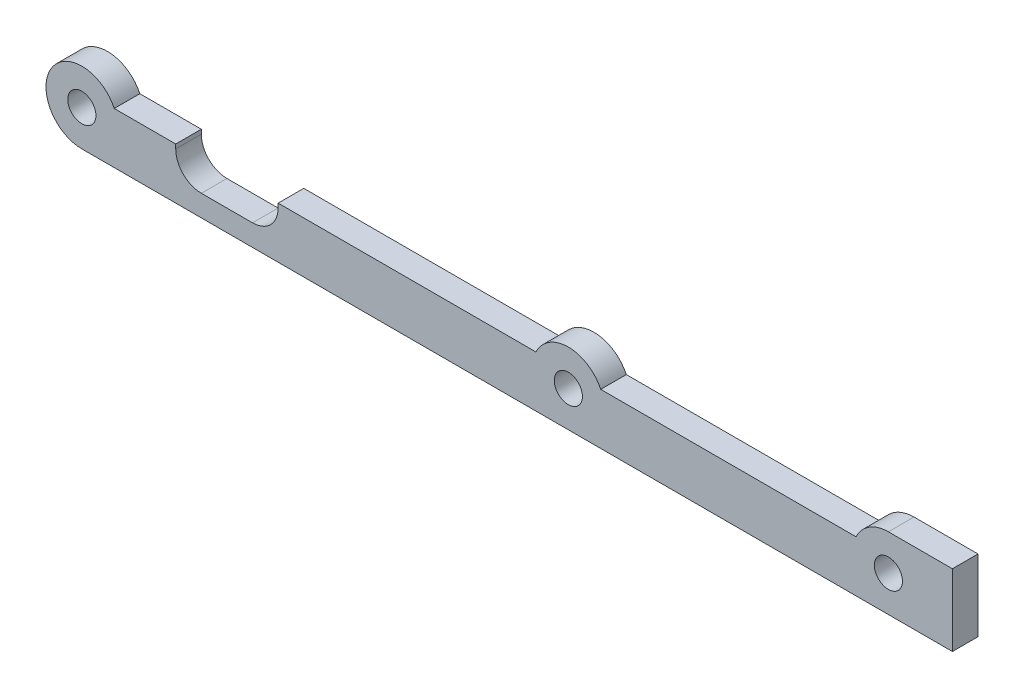
ISO-10303-21;
HEADER;
FILE_DESCRIPTION(('STEP AP214'),'2;1');
FILE_NAME('part.step','',(''),(''),'','','');
FILE_SCHEMA(('AUTOMOTIVE_DESIGN { 1 0 10303 214 1 1 1 1 }'));
ENDSEC;
DATA;
#1=APPLICATION_CONTEXT('core data for automotive mechanical design processes');
#2=APPLICATION_PROTOCOL_DEFINITION('international standard','automotive_design',2000,#1);
#3=PRODUCT_CONTEXT('',#1,'mechanical');
#4=PRODUCT('Part','Part','',(#3));
#5=PRODUCT_RELATED_PRODUCT_CATEGORY('part','',(#4));
#6=PRODUCT_DEFINITION_FORMATION('','',#4);
#7=PRODUCT_DEFINITION_CONTEXT('part definition',#1,'design');
#8=PRODUCT_DEFINITION('design','',#6,#7);
#9=PRODUCT_DEFINITION_SHAPE('','',#8);
#10=(LENGTH_UNIT() NAMED_UNIT(*) SI_UNIT(.MILLI.,.METRE.));
#11=(NAMED_UNIT(*) PLANE_ANGLE_UNIT() SI_UNIT($,.RADIAN.));
#12=(NAMED_UNIT(*) SI_UNIT($,.STERADIAN.) SOLID_ANGLE_UNIT());
#13=UNCERTAINTY_MEASURE_WITH_UNIT(LENGTH_MEASURE(1.E-05),#10,'distance_accuracy_value','');
#14=(GEOMETRIC_REPRESENTATION_CONTEXT(3) GLOBAL_UNCERTAINTY_ASSIGNED_CONTEXT((#13)) GLOBAL_UNIT_ASSIGNED_CONTEXT((#10,
#11,#12)) REPRESENTATION_CONTEXT('',''));
#15=CARTESIAN_POINT('',(0.,0.,0.));
#16=DIRECTION('',(0.,0.,1.));
#17=DIRECTION('',(1.,0.,0.));
#18=AXIS2_PLACEMENT_3D('',#15,#16,#17);
#19=CARTESIAN_POINT('',(-57.,0.,3.));
#20=DIRECTION('',(0.,0.,-1.));
#21=DIRECTION('',(-1.,0.,0.));
#22=AXIS2_PLACEMENT_3D('',#19,#20,#21);
#23=PLANE('',#22);
#24=CARTESIAN_POINT('',(-57.,0.,3.));
#25=DIRECTION('',(0.,0.,1.));
#26=DIRECTION('',(1.,0.,0.));
#27=AXIS2_PLACEMENT_3D('',#24,#25,#26);
#28=CIRCLE('',#27,1.65);
#29=CARTESIAN_POINT('',(-55.35,0.,3.));
#30=VERTEX_POINT('',#29);
#31=EDGE_CURVE('E500',#30,#30,#28,.T.);
#32=ORIENTED_EDGE('',*,*,#31,.F.);
#33=EDGE_LOOP('',(#32));
#34=FACE_BOUND('',#33,.T.);
#35=CARTESIAN_POINT('',(-57.,0.,3.));
#36=DIRECTION('',(0.,0.,1.));
#37=DIRECTION('',(-1.,0.,0.));
#38=AXIS2_PLACEMENT_3D('',#35,#36,#37);
#39=CIRCLE('',#38,4.2);
#40=CARTESIAN_POINT('',(-53.205266807798,1.8,3.));
#41=VERTEX_POINT('',#40);
#42=CARTESIAN_POINT('',(-57.,-4.2,3.));
#43=VERTEX_POINT('',#42);
#44=EDGE_CURVE('E165',#41,#43,#39,.T.);
#45=ORIENTED_EDGE('',*,*,#44,.T.);
#46=DIRECTION('',(1.,0.,0.));
#47=VECTOR('',#46,1.);
#48=CARTESIAN_POINT('',(-57.,-4.2,3.));
#49=LINE('',#48,#47);
#50=CARTESIAN_POINT('',(45.,-4.2,3.));
#51=VERTEX_POINT('',#50);
#52=EDGE_CURVE('E154',#43,#51,#49,.T.);
#53=ORIENTED_EDGE('',*,*,#52,.T.);
#54=DIRECTION('',(0.,1.,0.));
#55=VECTOR('',#54,1.);
#56=CARTESIAN_POINT('',(45.,-4.2,3.));
#57=LINE('',#56,#55);
#58=CARTESIAN_POINT('',(45.,4.2,3.));
#59=VERTEX_POINT('',#58);
#60=EDGE_CURVE('E164',#51,#59,#57,.T.);
#61=ORIENTED_EDGE('',*,*,#60,.T.);
#62=DIRECTION('',(-1.,0.,0.));
#63=VECTOR('',#62,1.);
#64=CARTESIAN_POINT('',(37.5,4.2,3.));
#65=LINE('',#64,#63);
#66=CARTESIAN_POINT('',(37.5,4.2,3.));
#67=VERTEX_POINT('',#66);
#68=EDGE_CURVE('E286',#59,#67,#65,.T.);
#69=ORIENTED_EDGE('',*,*,#68,.T.);
#70=CARTESIAN_POINT('',(37.5,0.,3.));
#71=DIRECTION('',(0.,0.,1.));
#72=DIRECTION('',(1.,0.,0.));
#73=AXIS2_PLACEMENT_3D('',#70,#71,#72);
#74=CIRCLE('',#73,4.2);
#75=CARTESIAN_POINT('',(33.7052668077979,1.8,3.));
#76=VERTEX_POINT('',#75);
#77=EDGE_CURVE('E303',#67,#76,#74,.T.);
#78=ORIENTED_EDGE('',*,*,#77,.T.);
#79=DIRECTION('',(-1.,0.,0.));
#80=VECTOR('',#79,1.);
#81=CARTESIAN_POINT('',(3.79473319220206,1.8,3.));
#82=LINE('',#81,#80);
#83=CARTESIAN_POINT('',(3.79473319220206,1.8,3.));
#84=VERTEX_POINT('',#83);
#85=EDGE_CURVE('E300',#76,#84,#82,.T.);
#86=ORIENTED_EDGE('',*,*,#85,.T.);
#87=CARTESIAN_POINT('',(0.,0.,3.));
#88=DIRECTION('',(0.,0.,1.));
#89=DIRECTION('',(1.,0.,0.));
#90=AXIS2_PLACEMENT_3D('',#87,#88,#89);
#91=CIRCLE('',#90,4.2);
#92=CARTESIAN_POINT('',(-3.79473319220206,1.8,3.));
#93=VERTEX_POINT('',#92);
#94=EDGE_CURVE('E302',#84,#93,#91,.T.);
#95=ORIENTED_EDGE('',*,*,#94,.T.);
#96=DIRECTION('',(-1.,0.,0.));
#97=VECTOR('',#96,1.);
#98=CARTESIAN_POINT('',(-34.,1.8,3.));
#99=LINE('',#98,#97);
#100=CARTESIAN_POINT('',(-34.,1.8,3.));
#101=VERTEX_POINT('',#100);
#102=EDGE_CURVE('E305',#93,#101,#99,.T.);
#103=ORIENTED_EDGE('',*,*,#102,.T.);
#104=DIRECTION('',(0.,-1.,0.));
#105=VECTOR('',#104,1.);
#106=CARTESIAN_POINT('',(-34.,-1.7,3.));
#107=LINE('',#106,#105);
#108=CARTESIAN_POINT('',(-34.,1.3,3.));
#109=VERTEX_POINT('',#108);
#110=EDGE_CURVE('E233',#101,#109,#107,.T.);
#111=ORIENTED_EDGE('',*,*,#110,.T.);
#112=CARTESIAN_POINT('',(-37.,1.3,3.));
#113=DIRECTION('',(0.,0.,-1.));
#114=DIRECTION('',(-1.,0.,0.));
#115=AXIS2_PLACEMENT_3D('',#112,#113,#114);
#116=CIRCLE('',#115,3.);
#117=CARTESIAN_POINT('',(-37.,-1.7,3.));
#118=VERTEX_POINT('',#117);
#119=EDGE_CURVE('E200',#109,#118,#116,.T.);
#120=ORIENTED_EDGE('',*,*,#119,.T.);
#121=DIRECTION('',(-1.,0.,0.));
#122=VECTOR('',#121,1.);
#123=CARTESIAN_POINT('',(-46.,-1.7,3.));
#124=LINE('',#123,#122);
#125=CARTESIAN_POINT('',(-43.,-1.7,3.));
#126=VERTEX_POINT('',#125);
#127=EDGE_CURVE('E227',#118,#126,#124,.T.);
#128=ORIENTED_EDGE('',*,*,#127,.T.);
#129=CARTESIAN_POINT('',(-43.,1.3,3.));
#130=DIRECTION('',(0.,0.,-1.));
#131=DIRECTION('',(-1.,0.,0.));
#132=AXIS2_PLACEMENT_3D('',#129,#130,#131);
#133=CIRCLE('',#132,3.);
#134=CARTESIAN_POINT('',(-46.,1.3,3.));
#135=VERTEX_POINT('',#134);
#136=EDGE_CURVE('E11',#126,#135,#133,.T.);
#137=ORIENTED_EDGE('',*,*,#136,.T.);
#138=DIRECTION('',(0.,1.,0.));
#139=VECTOR('',#138,1.);
#140=CARTESIAN_POINT('',(-46.,1.8,3.));
#141=LINE('',#140,#139);
#142=CARTESIAN_POINT('',(-46.,1.8,3.));
#143=VERTEX_POINT('',#142);
#144=EDGE_CURVE('E224',#135,#143,#141,.T.);
#145=ORIENTED_EDGE('',*,*,#144,.T.);
#146=DIRECTION('',(-1.,0.,0.));
#147=VECTOR('',#146,1.);
#148=CARTESIAN_POINT('',(-53.205266807798,1.8,3.));
#149=LINE('',#148,#147);
#150=EDGE_CURVE('E170',#143,#41,#149,.T.);
#151=ORIENTED_EDGE('',*,*,#150,.T.);
#152=EDGE_LOOP('',(#45,#53,#61,#69,#78,#86,#95,#103,#111,#120,#128,#137,#145,#151));
#153=FACE_BOUND('',#152,.T.);
#154=CARTESIAN_POINT('',(0.,0.,3.));
#155=DIRECTION('',(0.,0.,1.));
#156=DIRECTION('',(1.,0.,0.));
#157=AXIS2_PLACEMENT_3D('',#154,#155,#156);
#158=CIRCLE('',#157,1.65);
#159=CARTESIAN_POINT('',(1.65,0.,3.));
#160=VERTEX_POINT('',#159);
#161=EDGE_CURVE('E239',#160,#160,#158,.T.);
#162=ORIENTED_EDGE('',*,*,#161,.F.);
#163=EDGE_LOOP('',(#162));
#164=FACE_BOUND('',#163,.T.);
#165=CARTESIAN_POINT('',(37.5,0.,3.));
#166=DIRECTION('',(0.,0.,1.));
#167=DIRECTION('',(1.,0.,0.));
#168=AXIS2_PLACEMENT_3D('',#165,#166,#167);
#169=CIRCLE('',#168,1.65);
#170=CARTESIAN_POINT('',(39.15,0.,3.));
#171=VERTEX_POINT('',#170);
#172=EDGE_CURVE('E507',#171,#171,#169,.T.);
#173=ORIENTED_EDGE('',*,*,#172,.F.);
#174=EDGE_LOOP('',(#173));
#175=FACE_BOUND('',#174,.T.);
#176=ADVANCED_FACE('F41',(#34,#153,#164,#175),#23,.F.);
#177=CARTESIAN_POINT('',(-57.,0.,0.));
#178=DIRECTION('',(0.,0.,-1.));
#179=DIRECTION('',(-1.,0.,0.));
#180=AXIS2_PLACEMENT_3D('',#177,#178,#179);
#181=PLANE('',#180);
#182=CARTESIAN_POINT('',(-57.,0.,0.));
#183=DIRECTION('',(0.,0.,1.));
#184=DIRECTION('',(1.,0.,0.));
#185=AXIS2_PLACEMENT_3D('',#182,#183,#184);
#186=CIRCLE('',#185,1.65);
#187=CARTESIAN_POINT('',(-55.35,0.,0.));
#188=VERTEX_POINT('',#187);
#189=EDGE_CURVE('E504',#188,#188,#186,.T.);
#190=ORIENTED_EDGE('',*,*,#189,.T.);
#191=EDGE_LOOP('',(#190));
#192=FACE_BOUND('',#191,.T.);
#193=CARTESIAN_POINT('',(-57.,0.,0.));
#194=DIRECTION('',(0.,0.,1.));
#195=DIRECTION('',(-1.,0.,0.));
#196=AXIS2_PLACEMENT_3D('',#193,#194,#195);
#197=CIRCLE('',#196,4.2);
#198=CARTESIAN_POINT('',(-53.205266807798,1.8,0.));
#199=VERTEX_POINT('',#198);
#200=CARTESIAN_POINT('',(-57.,-4.2,0.));
#201=VERTEX_POINT('',#200);
#202=EDGE_CURVE('E178',#199,#201,#197,.T.);
#203=ORIENTED_EDGE('',*,*,#202,.F.);
#204=DIRECTION('',(-1.,0.,0.));
#205=VECTOR('',#204,1.);
#206=CARTESIAN_POINT('',(-53.205266807798,1.8,0.));
#207=LINE('',#206,#205);
#208=CARTESIAN_POINT('',(-46.,1.8,0.));
#209=VERTEX_POINT('',#208);
#210=EDGE_CURVE('E174',#209,#199,#207,.T.);
#211=ORIENTED_EDGE('',*,*,#210,.F.);
#212=DIRECTION('',(0.,1.,0.));
#213=VECTOR('',#212,1.);
#214=CARTESIAN_POINT('',(-46.,1.8,0.));
#215=LINE('',#214,#213);
#216=CARTESIAN_POINT('',(-46.,1.3,0.));
#217=VERTEX_POINT('',#216);
#218=EDGE_CURVE('E213',#217,#209,#215,.T.);
#219=ORIENTED_EDGE('',*,*,#218,.F.);
#220=CARTESIAN_POINT('',(-43.,1.3,0.));
#221=DIRECTION('',(0.,0.,-1.));
#222=DIRECTION('',(-1.,0.,0.));
#223=AXIS2_PLACEMENT_3D('',#220,#221,#222);
#224=CIRCLE('',#223,3.);
#225=CARTESIAN_POINT('',(-43.,-1.7,0.));
#226=VERTEX_POINT('',#225);
#227=EDGE_CURVE('E50',#217,#226,#224,.F.);
#228=ORIENTED_EDGE('',*,*,#227,.T.);
#229=DIRECTION('',(-1.,0.,0.));
#230=VECTOR('',#229,1.);
#231=CARTESIAN_POINT('',(-46.,-1.7,0.));
#232=LINE('',#231,#230);
#233=CARTESIAN_POINT('',(-37.,-1.7,0.));
#234=VERTEX_POINT('',#233);
#235=EDGE_CURVE('E211',#234,#226,#232,.T.);
#236=ORIENTED_EDGE('',*,*,#235,.F.);
#237=CARTESIAN_POINT('',(-37.,1.3,0.));
#238=DIRECTION('',(0.,0.,-1.));
#239=DIRECTION('',(-1.,0.,0.));
#240=AXIS2_PLACEMENT_3D('',#237,#238,#239);
#241=CIRCLE('',#240,3.);
#242=CARTESIAN_POINT('',(-34.,1.3,0.));
#243=VERTEX_POINT('',#242);
#244=EDGE_CURVE('E197',#234,#243,#241,.F.);
#245=ORIENTED_EDGE('',*,*,#244,.T.);
#246=DIRECTION('',(0.,-1.,0.));
#247=VECTOR('',#246,1.);
#248=CARTESIAN_POINT('',(-34.,-1.7,0.));
#249=LINE('',#248,#247);
#250=CARTESIAN_POINT('',(-34.,1.8,0.));
#251=VERTEX_POINT('',#250);
#252=EDGE_CURVE('E218',#251,#243,#249,.T.);
#253=ORIENTED_EDGE('',*,*,#252,.F.);
#254=DIRECTION('',(-1.,0.,0.));
#255=VECTOR('',#254,1.);
#256=CARTESIAN_POINT('',(-34.,1.8,0.));
#257=LINE('',#256,#255);
#258=CARTESIAN_POINT('',(-3.79473319220206,1.8,0.));
#259=VERTEX_POINT('',#258);
#260=EDGE_CURVE('E252',#259,#251,#257,.T.);
#261=ORIENTED_EDGE('',*,*,#260,.F.);
#262=CARTESIAN_POINT('',(0.,0.,0.));
#263=DIRECTION('',(0.,0.,1.));
#264=DIRECTION('',(1.,0.,0.));
#265=AXIS2_PLACEMENT_3D('',#262,#263,#264);
#266=CIRCLE('',#265,4.2);
#267=CARTESIAN_POINT('',(3.79473319220206,1.8,0.));
#268=VERTEX_POINT('',#267);
#269=EDGE_CURVE('E250',#268,#259,#266,.T.);
#270=ORIENTED_EDGE('',*,*,#269,.F.);
#271=DIRECTION('',(-1.,0.,0.));
#272=VECTOR('',#271,1.);
#273=CARTESIAN_POINT('',(3.79473319220206,1.8,0.));
#274=LINE('',#273,#272);
#275=CARTESIAN_POINT('',(33.7052668077979,1.8,0.));
#276=VERTEX_POINT('',#275);
#277=EDGE_CURVE('E248',#276,#268,#274,.T.);
#278=ORIENTED_EDGE('',*,*,#277,.F.);
#279=CARTESIAN_POINT('',(37.5,0.,0.));
#280=DIRECTION('',(0.,0.,1.));
#281=DIRECTION('',(1.,0.,0.));
#282=AXIS2_PLACEMENT_3D('',#279,#280,#281);
#283=CIRCLE('',#282,4.2);
#284=CARTESIAN_POINT('',(37.5,4.2,0.));
#285=VERTEX_POINT('',#284);
#286=EDGE_CURVE('E246',#285,#276,#283,.T.);
#287=ORIENTED_EDGE('',*,*,#286,.F.);
#288=DIRECTION('',(-1.,0.,0.));
#289=VECTOR('',#288,1.);
#290=CARTESIAN_POINT('',(37.5,4.2,0.));
#291=LINE('',#290,#289);
#292=CARTESIAN_POINT('',(45.,4.2,0.));
#293=VERTEX_POINT('',#292);
#294=EDGE_CURVE('E244',#293,#285,#291,.T.);
#295=ORIENTED_EDGE('',*,*,#294,.F.);
#296=DIRECTION('',(0.,1.,0.));
#297=VECTOR('',#296,1.);
#298=CARTESIAN_POINT('',(45.,-4.2,0.));
#299=LINE('',#298,#297);
#300=CARTESIAN_POINT('',(45.,-4.2,0.));
#301=VERTEX_POINT('',#300);
#302=EDGE_CURVE('E242',#301,#293,#299,.T.);
#303=ORIENTED_EDGE('',*,*,#302,.F.);
#304=DIRECTION('',(1.,0.,0.));
#305=VECTOR('',#304,1.);
#306=CARTESIAN_POINT('',(-57.,-4.2,0.));
#307=LINE('',#306,#305);
#308=EDGE_CURVE('E238',#201,#301,#307,.T.);
#309=ORIENTED_EDGE('',*,*,#308,.F.);
#310=EDGE_LOOP('',(#203,#211,#219,#228,#236,#245,#253,#261,#270,#278,#287,#295,#303,#309));
#311=FACE_BOUND('',#310,.T.);
#312=CARTESIAN_POINT('',(0.,0.,0.));
#313=DIRECTION('',(0.,0.,1.));
#314=DIRECTION('',(1.,0.,0.));
#315=AXIS2_PLACEMENT_3D('',#312,#313,#314);
#316=CIRCLE('',#315,1.65);
#317=CARTESIAN_POINT('',(1.65,0.,0.));
#318=VERTEX_POINT('',#317);
#319=EDGE_CURVE('E496',#318,#318,#316,.T.);
#320=ORIENTED_EDGE('',*,*,#319,.T.);
#321=EDGE_LOOP('',(#320));
#322=FACE_BOUND('',#321,.T.);
#323=CARTESIAN_POINT('',(37.5,0.,0.));
#324=DIRECTION('',(0.,0.,1.));
#325=DIRECTION('',(1.,0.,0.));
#326=AXIS2_PLACEMENT_3D('',#323,#324,#325);
#327=CIRCLE('',#326,1.65);
#328=CARTESIAN_POINT('',(39.15,0.,0.));
#329=VERTEX_POINT('',#328);
#330=EDGE_CURVE('E510',#329,#329,#327,.T.);
#331=ORIENTED_EDGE('',*,*,#330,.T.);
#332=EDGE_LOOP('',(#331));
#333=FACE_BOUND('',#332,.T.);
#334=ADVANCED_FACE('F209',(#192,#311,#322,#333),#181,.T.);
#335=CARTESIAN_POINT('',(-57.,0.,3.));
#336=DIRECTION('',(0.,0.,-1.));
#337=DIRECTION('',(-1.,0.,0.));
#338=AXIS2_PLACEMENT_3D('',#335,#336,#337);
#339=CYLINDRICAL_SURFACE('',#338,4.2);
#340=ORIENTED_EDGE('',*,*,#202,.T.);
#341=DIRECTION('',(0.,0.,-1.));
#342=VECTOR('',#341,1.);
#343=CARTESIAN_POINT('',(-57.,-4.2,3.));
#344=LINE('',#343,#342);
#345=EDGE_CURVE('E158',#43,#201,#344,.T.);
#346=ORIENTED_EDGE('',*,*,#345,.F.);
#347=ORIENTED_EDGE('',*,*,#44,.F.);
#348=DIRECTION('',(0.,0.,-1.));
#349=VECTOR('',#348,1.);
#350=CARTESIAN_POINT('',(-53.205266807798,1.8,3.));
#351=LINE('',#350,#349);
#352=EDGE_CURVE('E230',#41,#199,#351,.T.);
#353=ORIENTED_EDGE('',*,*,#352,.T.);
#354=EDGE_LOOP('',(#340,#346,#347,#353));
#355=FACE_BOUND('',#354,.T.);
#356=ADVANCED_FACE('F176',(#355),#339,.T.);
#357=CARTESIAN_POINT('',(-57.,-4.2,3.));
#358=DIRECTION('',(0.,1.,0.));
#359=DIRECTION('',(0.,0.,1.));
#360=AXIS2_PLACEMENT_3D('',#357,#358,#359);
#361=PLANE('',#360);
#362=ORIENTED_EDGE('',*,*,#308,.T.);
#363=DIRECTION('',(0.,0.,-1.));
#364=VECTOR('',#363,1.);
#365=CARTESIAN_POINT('',(45.,-4.2,3.));
#366=LINE('',#365,#364);
#367=EDGE_CURVE('E161',#51,#301,#366,.T.);
#368=ORIENTED_EDGE('',*,*,#367,.F.);
#369=ORIENTED_EDGE('',*,*,#52,.F.);
#370=ORIENTED_EDGE('',*,*,#345,.T.);
#371=EDGE_LOOP('',(#362,#368,#369,#370));
#372=FACE_BOUND('',#371,.T.);
#373=ADVANCED_FACE('F156',(#372),#361,.F.);
#374=CARTESIAN_POINT('',(45.,-4.2,3.));
#375=DIRECTION('',(-1.,0.,0.));
#376=DIRECTION('',(0.,0.,1.));
#377=AXIS2_PLACEMENT_3D('',#374,#375,#376);
#378=PLANE('',#377);
#379=ORIENTED_EDGE('',*,*,#302,.T.);
#380=DIRECTION('',(0.,0.,-1.));
#381=VECTOR('',#380,1.);
#382=CARTESIAN_POINT('',(45.,4.2,3.));
#383=LINE('',#382,#381);
#384=EDGE_CURVE('E184',#59,#293,#383,.T.);
#385=ORIENTED_EDGE('',*,*,#384,.F.);
#386=ORIENTED_EDGE('',*,*,#60,.F.);
#387=ORIENTED_EDGE('',*,*,#367,.T.);
#388=EDGE_LOOP('',(#379,#385,#386,#387));
#389=FACE_BOUND('',#388,.T.);
#390=ADVANCED_FACE('F434',(#389),#378,.F.);
#391=CARTESIAN_POINT('',(37.5,4.2,3.));
#392=DIRECTION('',(0.,-1.,0.));
#393=DIRECTION('',(1.,0.,0.));
#394=AXIS2_PLACEMENT_3D('',#391,#392,#393);
#395=PLANE('',#394);
#396=ORIENTED_EDGE('',*,*,#294,.T.);
#397=DIRECTION('',(0.,0.,-1.));
#398=VECTOR('',#397,1.);
#399=CARTESIAN_POINT('',(37.5,4.2,3.));
#400=LINE('',#399,#398);
#401=EDGE_CURVE('E277',#67,#285,#400,.T.);
#402=ORIENTED_EDGE('',*,*,#401,.F.);
#403=ORIENTED_EDGE('',*,*,#68,.F.);
#404=ORIENTED_EDGE('',*,*,#384,.T.);
#405=EDGE_LOOP('',(#396,#402,#403,#404));
#406=FACE_BOUND('',#405,.T.);
#407=ADVANCED_FACE('F284',(#406),#395,.F.);
#408=CARTESIAN_POINT('',(37.5,0.,3.));
#409=DIRECTION('',(0.,0.,-1.));
#410=DIRECTION('',(-1.,0.,0.));
#411=AXIS2_PLACEMENT_3D('',#408,#409,#410);
#412=CYLINDRICAL_SURFACE('',#411,4.2);
#413=ORIENTED_EDGE('',*,*,#286,.T.);
#414=DIRECTION('',(0.,0.,-1.));
#415=VECTOR('',#414,1.);
#416=CARTESIAN_POINT('',(33.7052668077979,1.8,3.));
#417=LINE('',#416,#415);
#418=EDGE_CURVE('E274',#76,#276,#417,.T.);
#419=ORIENTED_EDGE('',*,*,#418,.F.);
#420=ORIENTED_EDGE('',*,*,#77,.F.);
#421=ORIENTED_EDGE('',*,*,#401,.T.);
#422=EDGE_LOOP('',(#413,#419,#420,#421));
#423=FACE_BOUND('',#422,.T.);
#424=ADVANCED_FACE('F294',(#423),#412,.T.);
#425=CARTESIAN_POINT('',(3.79473319220206,1.8,3.));
#426=DIRECTION('',(0.,-1.,0.));
#427=DIRECTION('',(0.,0.,-1.));
#428=AXIS2_PLACEMENT_3D('',#425,#426,#427);
#429=PLANE('',#428);
#430=ORIENTED_EDGE('',*,*,#277,.T.);
#431=DIRECTION('',(0.,0.,-1.));
#432=VECTOR('',#431,1.);
#433=CARTESIAN_POINT('',(3.79473319220206,1.8,3.));
#434=LINE('',#433,#432);
#435=EDGE_CURVE('E271',#84,#268,#434,.T.);
#436=ORIENTED_EDGE('',*,*,#435,.F.);
#437=ORIENTED_EDGE('',*,*,#85,.F.);
#438=ORIENTED_EDGE('',*,*,#418,.T.);
#439=EDGE_LOOP('',(#430,#436,#437,#438));
#440=FACE_BOUND('',#439,.T.);
#441=ADVANCED_FACE('F298',(#440),#429,.F.);
#442=CARTESIAN_POINT('',(0.,0.,3.));
#443=DIRECTION('',(0.,0.,-1.));
#444=DIRECTION('',(-1.,0.,0.));
#445=AXIS2_PLACEMENT_3D('',#442,#443,#444);
#446=CYLINDRICAL_SURFACE('',#445,4.2);
#447=ORIENTED_EDGE('',*,*,#269,.T.);
#448=DIRECTION('',(0.,0.,-1.));
#449=VECTOR('',#448,1.);
#450=CARTESIAN_POINT('',(-3.79473319220206,1.8,3.));
#451=LINE('',#450,#449);
#452=EDGE_CURVE('E268',#93,#259,#451,.T.);
#453=ORIENTED_EDGE('',*,*,#452,.F.);
#454=ORIENTED_EDGE('',*,*,#94,.F.);
#455=ORIENTED_EDGE('',*,*,#435,.T.);
#456=EDGE_LOOP('',(#447,#453,#454,#455));
#457=FACE_BOUND('',#456,.T.);
#458=ADVANCED_FACE('F328',(#457),#446,.T.);
#459=CARTESIAN_POINT('',(-34.,1.8,3.));
#460=DIRECTION('',(0.,-1.,0.));
#461=DIRECTION('',(0.,0.,-1.));
#462=AXIS2_PLACEMENT_3D('',#459,#460,#461);
#463=PLANE('',#462);
#464=ORIENTED_EDGE('',*,*,#260,.T.);
#465=DIRECTION('',(0.,0.,-1.));
#466=VECTOR('',#465,1.);
#467=CARTESIAN_POINT('',(-34.,1.8,3.));
#468=LINE('',#467,#466);
#469=EDGE_CURVE('E264',#101,#251,#468,.T.);
#470=ORIENTED_EDGE('',*,*,#469,.F.);
#471=ORIENTED_EDGE('',*,*,#102,.F.);
#472=ORIENTED_EDGE('',*,*,#452,.T.);
#473=EDGE_LOOP('',(#464,#470,#471,#472));
#474=FACE_BOUND('',#473,.T.);
#475=ADVANCED_FACE('F325',(#474),#463,.F.);
#476=CARTESIAN_POINT('',(-34.,-1.7,3.));
#477=DIRECTION('',(1.,0.,0.));
#478=DIRECTION('',(0.,0.,-1.));
#479=AXIS2_PLACEMENT_3D('',#476,#477,#478);
#480=PLANE('',#479);
#481=ORIENTED_EDGE('',*,*,#252,.T.);
#482=DIRECTION('',(0.,0.,-1.));
#483=VECTOR('',#482,1.);
#484=CARTESIAN_POINT('',(-34.,1.3,3.));
#485=LINE('',#484,#483);
#486=EDGE_CURVE('E191',#243,#109,#485,.F.);
#487=ORIENTED_EDGE('',*,*,#486,.T.);
#488=ORIENTED_EDGE('',*,*,#110,.F.);
#489=ORIENTED_EDGE('',*,*,#469,.T.);
#490=EDGE_LOOP('',(#481,#487,#488,#489));
#491=FACE_BOUND('',#490,.T.);
#492=ADVANCED_FACE('F323',(#491),#480,.F.);
#493=CARTESIAN_POINT('',(-46.,-1.7,3.));
#494=DIRECTION('',(0.,-1.,0.));
#495=DIRECTION('',(0.,0.,-1.));
#496=AXIS2_PLACEMENT_3D('',#493,#494,#495);
#497=PLANE('',#496);
#498=ORIENTED_EDGE('',*,*,#127,.F.);
#499=DIRECTION('',(0.,0.,-1.));
#500=VECTOR('',#499,1.);
#501=CARTESIAN_POINT('',(-37.,-1.7,0.));
#502=LINE('',#501,#500);
#503=EDGE_CURVE('E182',#118,#234,#502,.T.);
#504=ORIENTED_EDGE('',*,*,#503,.T.);
#505=ORIENTED_EDGE('',*,*,#235,.T.);
#506=DIRECTION('',(0.,0.,-1.));
#507=VECTOR('',#506,1.);
#508=CARTESIAN_POINT('',(-43.,-1.7,3.));
#509=LINE('',#508,#507);
#510=EDGE_CURVE('E179',#226,#126,#509,.F.);
#511=ORIENTED_EDGE('',*,*,#510,.T.);
#512=EDGE_LOOP('',(#498,#504,#505,#511));
#513=FACE_BOUND('',#512,.T.);
#514=ADVANCED_FACE('F216',(#513),#497,.F.);
#515=CARTESIAN_POINT('',(-46.,1.8,3.));
#516=DIRECTION('',(-1.,0.,0.));
#517=DIRECTION('',(0.,0.,1.));
#518=AXIS2_PLACEMENT_3D('',#515,#516,#517);
#519=PLANE('',#518);
#520=ORIENTED_EDGE('',*,*,#144,.F.);
#521=DIRECTION('',(0.,0.,-1.));
#522=VECTOR('',#521,1.);
#523=CARTESIAN_POINT('',(-46.,1.3,0.));
#524=LINE('',#523,#522);
#525=EDGE_CURVE('E194',#135,#217,#524,.T.);
#526=ORIENTED_EDGE('',*,*,#525,.T.);
#527=ORIENTED_EDGE('',*,*,#218,.T.);
#528=DIRECTION('',(0.,0.,-1.));
#529=VECTOR('',#528,1.);
#530=CARTESIAN_POINT('',(-46.,1.8,3.));
#531=LINE('',#530,#529);
#532=EDGE_CURVE('E225',#143,#209,#531,.T.);
#533=ORIENTED_EDGE('',*,*,#532,.F.);
#534=EDGE_LOOP('',(#520,#526,#527,#533));
#535=FACE_BOUND('',#534,.T.);
#536=ADVANCED_FACE('F221',(#535),#519,.F.);
#537=CARTESIAN_POINT('',(-53.205266807798,1.8,3.));
#538=DIRECTION('',(0.,-1.,0.));
#539=DIRECTION('',(0.,0.,-1.));
#540=AXIS2_PLACEMENT_3D('',#537,#538,#539);
#541=PLANE('',#540);
#542=ORIENTED_EDGE('',*,*,#210,.T.);
#543=ORIENTED_EDGE('',*,*,#352,.F.);
#544=ORIENTED_EDGE('',*,*,#150,.F.);
#545=ORIENTED_EDGE('',*,*,#532,.T.);
#546=EDGE_LOOP('',(#542,#543,#544,#545));
#547=FACE_BOUND('',#546,.T.);
#548=ADVANCED_FACE('F350',(#547),#541,.F.);
#549=CARTESIAN_POINT('',(0.,0.,3.));
#550=DIRECTION('',(0.,0.,-1.));
#551=DIRECTION('',(-1.,0.,0.));
#552=AXIS2_PLACEMENT_3D('',#549,#550,#551);
#553=CYLINDRICAL_SURFACE('',#552,1.65);
#554=ORIENTED_EDGE('',*,*,#161,.T.);
#555=EDGE_LOOP('',(#554));
#556=FACE_BOUND('',#555,.T.);
#557=ORIENTED_EDGE('',*,*,#319,.F.);
#558=EDGE_LOOP('',(#557));
#559=FACE_BOUND('',#558,.T.);
#560=ADVANCED_FACE('F347',(#556,#559),#553,.F.);
#561=CARTESIAN_POINT('',(-57.,0.,3.));
#562=DIRECTION('',(0.,0.,-1.));
#563=DIRECTION('',(-1.,0.,0.));
#564=AXIS2_PLACEMENT_3D('',#561,#562,#563);
#565=CYLINDRICAL_SURFACE('',#564,1.65);
#566=ORIENTED_EDGE('',*,*,#31,.T.);
#567=EDGE_LOOP('',(#566));
#568=FACE_BOUND('',#567,.T.);
#569=ORIENTED_EDGE('',*,*,#189,.F.);
#570=EDGE_LOOP('',(#569));
#571=FACE_BOUND('',#570,.T.);
#572=ADVANCED_FACE('F383',(#568,#571),#565,.F.);
#573=CARTESIAN_POINT('',(37.5,0.,3.));
#574=DIRECTION('',(0.,0.,-1.));
#575=DIRECTION('',(-1.,0.,0.));
#576=AXIS2_PLACEMENT_3D('',#573,#574,#575);
#577=CYLINDRICAL_SURFACE('',#576,1.65);
#578=ORIENTED_EDGE('',*,*,#172,.T.);
#579=EDGE_LOOP('',(#578));
#580=FACE_BOUND('',#579,.T.);
#581=ORIENTED_EDGE('',*,*,#330,.F.);
#582=EDGE_LOOP('',(#581));
#583=FACE_BOUND('',#582,.T.);
#584=ADVANCED_FACE('F390',(#580,#583),#577,.F.);
#585=CARTESIAN_POINT('',(-37.,1.3,3.));
#586=DIRECTION('',(0.,0.,1.));
#587=DIRECTION('',(1.,0.,0.));
#588=AXIS2_PLACEMENT_3D('',#585,#586,#587);
#589=CYLINDRICAL_SURFACE('',#588,3.);
#590=ORIENTED_EDGE('',*,*,#119,.F.);
#591=ORIENTED_EDGE('',*,*,#486,.F.);
#592=ORIENTED_EDGE('',*,*,#244,.F.);
#593=ORIENTED_EDGE('',*,*,#503,.F.);
#594=EDGE_LOOP('',(#590,#591,#592,#593));
#595=FACE_BOUND('',#594,.T.);
#596=ADVANCED_FACE('F320',(#595),#589,.F.);
#597=CARTESIAN_POINT('',(-43.,1.3,3.));
#598=DIRECTION('',(0.,0.,1.));
#599=DIRECTION('',(1.,0.,0.));
#600=AXIS2_PLACEMENT_3D('',#597,#598,#599);
#601=CYLINDRICAL_SURFACE('',#600,3.);
#602=ORIENTED_EDGE('',*,*,#136,.F.);
#603=ORIENTED_EDGE('',*,*,#510,.F.);
#604=ORIENTED_EDGE('',*,*,#227,.F.);
#605=ORIENTED_EDGE('',*,*,#525,.F.);
#606=EDGE_LOOP('',(#602,#603,#604,#605));
#607=FACE_BOUND('',#606,.T.);
#608=ADVANCED_FACE('F43',(#607),#601,.F.);
#609=CLOSED_SHELL('',(#176,#334,#356,#373,#390,#407,#424,#441,#458,#475,#492,#514,#536,#548,
#560,#572,#584,#596,#608));
#610=MANIFOLD_SOLID_BREP('B2',#609);
#611=ADVANCED_BREP_SHAPE_REPRESENTATION('',(#18,#610),#14);
#612=SHAPE_DEFINITION_REPRESENTATION(#9,#611);
ENDSEC;
END-ISO-10303-21;
